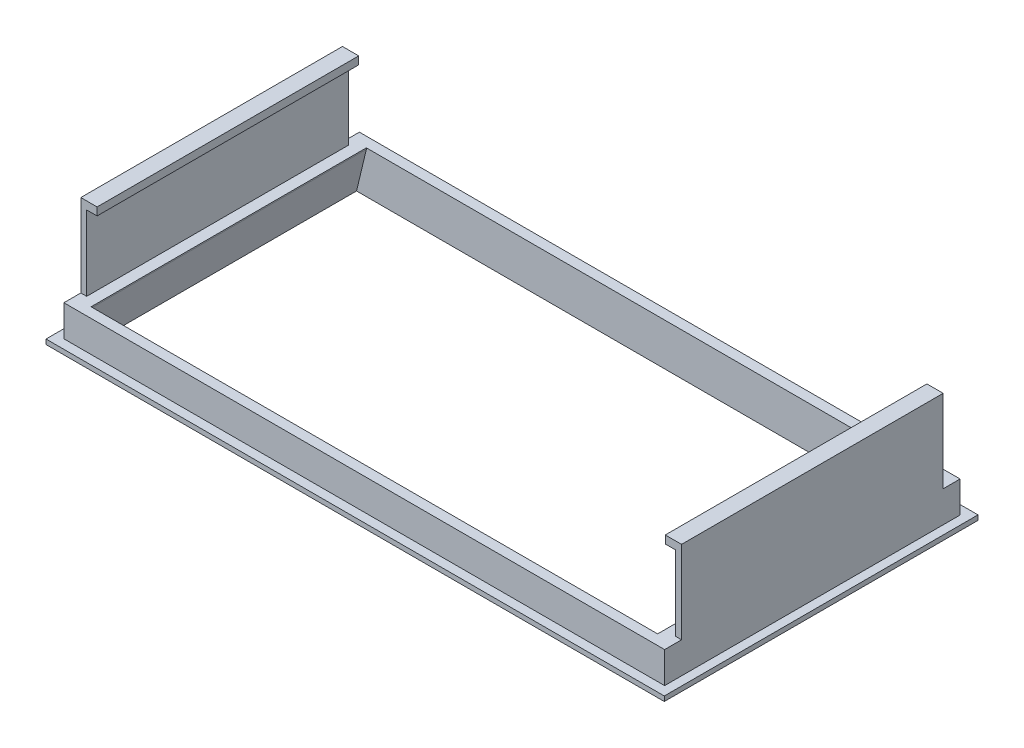
ISO-10303-21;
HEADER;
FILE_DESCRIPTION(('STEP AP214'),'2;1');
FILE_NAME('part.step','',(''),(''),'','','');
FILE_SCHEMA(('AUTOMOTIVE_DESIGN { 1 0 10303 214 1 1 1 1 }'));
ENDSEC;
DATA;
#1=APPLICATION_CONTEXT('core data for automotive mechanical design processes');
#2=APPLICATION_PROTOCOL_DEFINITION('international standard','automotive_design',2000,#1);
#3=PRODUCT_CONTEXT('',#1,'mechanical');
#4=PRODUCT('Part','Part','',(#3));
#5=PRODUCT_RELATED_PRODUCT_CATEGORY('part','',(#4));
#6=PRODUCT_DEFINITION_FORMATION('','',#4);
#7=PRODUCT_DEFINITION_CONTEXT('part definition',#1,'design');
#8=PRODUCT_DEFINITION('design','',#6,#7);
#9=PRODUCT_DEFINITION_SHAPE('','',#8);
#10=(LENGTH_UNIT() NAMED_UNIT(*) SI_UNIT(.MILLI.,.METRE.));
#11=(NAMED_UNIT(*) PLANE_ANGLE_UNIT() SI_UNIT($,.RADIAN.));
#12=(NAMED_UNIT(*) SI_UNIT($,.STERADIAN.) SOLID_ANGLE_UNIT());
#13=UNCERTAINTY_MEASURE_WITH_UNIT(LENGTH_MEASURE(1.E-05),#10,'distance_accuracy_value','');
#14=(GEOMETRIC_REPRESENTATION_CONTEXT(3) GLOBAL_UNCERTAINTY_ASSIGNED_CONTEXT((#13)) GLOBAL_UNIT_ASSIGNED_CONTEXT((#10,
#11,#12)) REPRESENTATION_CONTEXT('',''));
#15=CARTESIAN_POINT('',(0.,0.,0.));
#16=DIRECTION('',(0.,0.,1.));
#17=DIRECTION('',(1.,0.,0.));
#18=AXIS2_PLACEMENT_3D('',#15,#16,#17);
#19=CARTESIAN_POINT('',(-46.15,18.,20.1));
#20=DIRECTION('',(0.,0.,-1.));
#21=DIRECTION('',(-1.,0.,0.));
#22=AXIS2_PLACEMENT_3D('',#19,#20,#21);
#23=PLANE('',#22);
#24=DIRECTION('',(1.,0.,0.));
#25=VECTOR('',#24,1.);
#26=CARTESIAN_POINT('',(-46.15,18.,20.1));
#27=LINE('',#26,#25);
#28=CARTESIAN_POINT('',(-45.25,18.,20.1));
#29=VERTEX_POINT('',#28);
#30=CARTESIAN_POINT('',(-43.65,18.,20.1));
#31=VERTEX_POINT('',#30);
#32=EDGE_CURVE('E238',#29,#31,#27,.T.);
#33=ORIENTED_EDGE('',*,*,#32,.T.);
#34=DIRECTION('',(0.,1.,0.));
#35=VECTOR('',#34,1.);
#36=CARTESIAN_POINT('',(-43.65,18.,20.1));
#37=LINE('',#36,#35);
#38=CARTESIAN_POINT('',(-43.65,19.2,20.1));
#39=VERTEX_POINT('',#38);
#40=EDGE_CURVE('E50',#31,#39,#37,.T.);
#41=ORIENTED_EDGE('',*,*,#40,.T.);
#42=DIRECTION('',(1.,0.,0.));
#43=VECTOR('',#42,1.);
#44=CARTESIAN_POINT('',(-46.15,19.2,20.1));
#45=LINE('',#44,#43);
#46=CARTESIAN_POINT('',(-46.15,19.2,20.1));
#47=VERTEX_POINT('',#46);
#48=EDGE_CURVE('E256',#47,#39,#45,.T.);
#49=ORIENTED_EDGE('',*,*,#48,.F.);
#50=DIRECTION('',(0.,-1.,0.));
#51=VECTOR('',#50,1.);
#52=CARTESIAN_POINT('',(-46.15,18.,20.1));
#53=LINE('',#52,#51);
#54=CARTESIAN_POINT('',(-46.15,6.5,20.1));
#55=VERTEX_POINT('',#54);
#56=EDGE_CURVE('E330',#47,#55,#53,.T.);
#57=ORIENTED_EDGE('',*,*,#56,.T.);
#58=DIRECTION('',(1.,0.,0.));
#59=VECTOR('',#58,1.);
#60=CARTESIAN_POINT('',(-46.15,6.5,20.1));
#61=LINE('',#60,#59);
#62=CARTESIAN_POINT('',(-45.25,6.5,20.1));
#63=VERTEX_POINT('',#62);
#64=EDGE_CURVE('E297',#55,#63,#61,.T.);
#65=ORIENTED_EDGE('',*,*,#64,.T.);
#66=DIRECTION('',(0.,1.,0.));
#67=VECTOR('',#66,1.);
#68=CARTESIAN_POINT('',(-45.25,6.5,20.1));
#69=LINE('',#68,#67);
#70=EDGE_CURVE('E278',#63,#29,#69,.T.);
#71=ORIENTED_EDGE('',*,*,#70,.T.);
#72=EDGE_LOOP('',(#33,#41,#49,#57,#65,#71));
#73=FACE_BOUND('',#72,.T.);
#74=ADVANCED_FACE('F32',(#73),#23,.F.);
#75=CARTESIAN_POINT('',(-46.15,18.,-20.1));
#76=DIRECTION('',(0.,0.,1.));
#77=DIRECTION('',(1.,0.,0.));
#78=AXIS2_PLACEMENT_3D('',#75,#76,#77);
#79=PLANE('',#78);
#80=DIRECTION('',(-1.,0.,0.));
#81=VECTOR('',#80,1.);
#82=CARTESIAN_POINT('',(-46.15,19.2,-20.1));
#83=LINE('',#82,#81);
#84=CARTESIAN_POINT('',(-43.65,19.2,-20.1));
#85=VERTEX_POINT('',#84);
#86=CARTESIAN_POINT('',(-46.15,19.2,-20.1));
#87=VERTEX_POINT('',#86);
#88=EDGE_CURVE('E262',#85,#87,#83,.T.);
#89=ORIENTED_EDGE('',*,*,#88,.F.);
#90=DIRECTION('',(0.,1.,0.));
#91=VECTOR('',#90,1.);
#92=CARTESIAN_POINT('',(-43.65,18.,-20.1));
#93=LINE('',#92,#91);
#94=CARTESIAN_POINT('',(-43.65,18.,-20.1));
#95=VERTEX_POINT('',#94);
#96=EDGE_CURVE('E239',#95,#85,#93,.T.);
#97=ORIENTED_EDGE('',*,*,#96,.F.);
#98=DIRECTION('',(-1.,0.,0.));
#99=VECTOR('',#98,1.);
#100=CARTESIAN_POINT('',(-46.15,18.,-20.1));
#101=LINE('',#100,#99);
#102=CARTESIAN_POINT('',(-45.25,18.,-20.1));
#103=VERTEX_POINT('',#102);
#104=EDGE_CURVE('E241',#95,#103,#101,.T.);
#105=ORIENTED_EDGE('',*,*,#104,.T.);
#106=DIRECTION('',(0.,1.,0.));
#107=VECTOR('',#106,1.);
#108=CARTESIAN_POINT('',(-45.25,6.5,-20.1));
#109=LINE('',#108,#107);
#110=CARTESIAN_POINT('',(-45.25,6.5,-20.1));
#111=VERTEX_POINT('',#110);
#112=EDGE_CURVE('E294',#111,#103,#109,.T.);
#113=ORIENTED_EDGE('',*,*,#112,.F.);
#114=DIRECTION('',(-1.,0.,0.));
#115=VECTOR('',#114,1.);
#116=CARTESIAN_POINT('',(-46.15,6.5,-20.1));
#117=LINE('',#116,#115);
#118=CARTESIAN_POINT('',(-46.15,6.5,-20.1));
#119=VERTEX_POINT('',#118);
#120=EDGE_CURVE('E11',#111,#119,#117,.T.);
#121=ORIENTED_EDGE('',*,*,#120,.T.);
#122=DIRECTION('',(0.,-1.,0.));
#123=VECTOR('',#122,1.);
#124=CARTESIAN_POINT('',(-46.15,18.,-20.1));
#125=LINE('',#124,#123);
#126=EDGE_CURVE('E337',#87,#119,#125,.T.);
#127=ORIENTED_EDGE('',*,*,#126,.F.);
#128=EDGE_LOOP('',(#89,#97,#105,#113,#121,#127));
#129=FACE_BOUND('',#128,.T.);
#130=ADVANCED_FACE('F525',(#129),#79,.F.);
#131=CARTESIAN_POINT('',(-46.15,19.2,20.1));
#132=DIRECTION('',(0.,1.,0.));
#133=DIRECTION('',(0.,0.,1.));
#134=AXIS2_PLACEMENT_3D('',#131,#132,#133);
#135=PLANE('',#134);
#136=DIRECTION('',(0.,0.,1.));
#137=VECTOR('',#136,1.);
#138=CARTESIAN_POINT('',(-43.65,19.2,-20.1));
#139=LINE('',#138,#137);
#140=EDGE_CURVE('E617',#85,#39,#139,.T.);
#141=ORIENTED_EDGE('',*,*,#140,.F.);
#142=ORIENTED_EDGE('',*,*,#88,.T.);
#143=DIRECTION('',(0.,0.,1.));
#144=VECTOR('',#143,1.);
#145=CARTESIAN_POINT('',(-46.15,19.2,-20.1));
#146=LINE('',#145,#144);
#147=EDGE_CURVE('E252',#87,#47,#146,.T.);
#148=ORIENTED_EDGE('',*,*,#147,.T.);
#149=ORIENTED_EDGE('',*,*,#48,.T.);
#150=EDGE_LOOP('',(#141,#142,#148,#149));
#151=FACE_BOUND('',#150,.T.);
#152=ADVANCED_FACE('F531',(#151),#135,.T.);
#153=CARTESIAN_POINT('',(-46.15,18.,20.1));
#154=DIRECTION('',(0.,1.,0.));
#155=DIRECTION('',(0.,0.,1.));
#156=AXIS2_PLACEMENT_3D('',#153,#154,#155);
#157=PLANE('',#156);
#158=ORIENTED_EDGE('',*,*,#104,.F.);
#159=DIRECTION('',(0.,0.,1.));
#160=VECTOR('',#159,1.);
#161=CARTESIAN_POINT('',(-43.65,18.,-20.1));
#162=LINE('',#161,#160);
#163=EDGE_CURVE('E224',#95,#31,#162,.T.);
#164=ORIENTED_EDGE('',*,*,#163,.T.);
#165=ORIENTED_EDGE('',*,*,#32,.F.);
#166=DIRECTION('',(0.,0.,1.));
#167=VECTOR('',#166,1.);
#168=CARTESIAN_POINT('',(-45.25,18.,-20.1));
#169=LINE('',#168,#167);
#170=EDGE_CURVE('E265',#103,#29,#169,.T.);
#171=ORIENTED_EDGE('',*,*,#170,.F.);
#172=EDGE_LOOP('',(#158,#164,#165,#171));
#173=FACE_BOUND('',#172,.T.);
#174=ADVANCED_FACE('F582',(#173),#157,.F.);
#175=CARTESIAN_POINT('',(-47.5,1.7,24.1));
#176=DIRECTION('',(0.,1.,0.));
#177=DIRECTION('',(0.,0.,1.));
#178=AXIS2_PLACEMENT_3D('',#175,#176,#177);
#179=PLANE('',#178);
#180=DIRECTION('',(0.,0.,1.));
#181=VECTOR('',#180,1.);
#182=CARTESIAN_POINT('',(-47.5,1.7,-24.1));
#183=LINE('',#182,#181);
#184=CARTESIAN_POINT('',(-47.5,1.7,-24.1));
#185=VERTEX_POINT('',#184);
#186=CARTESIAN_POINT('',(-47.5,1.7,24.1));
#187=VERTEX_POINT('',#186);
#188=EDGE_CURVE('E387',#185,#187,#183,.T.);
#189=ORIENTED_EDGE('',*,*,#188,.T.);
#190=DIRECTION('',(1.,0.,0.));
#191=VECTOR('',#190,1.);
#192=CARTESIAN_POINT('',(-47.5,1.7,24.1));
#193=LINE('',#192,#191);
#194=CARTESIAN_POINT('',(47.5,1.7,24.1));
#195=VERTEX_POINT('',#194);
#196=EDGE_CURVE('E390',#187,#195,#193,.T.);
#197=ORIENTED_EDGE('',*,*,#196,.T.);
#198=DIRECTION('',(0.,0.,-1.));
#199=VECTOR('',#198,1.);
#200=CARTESIAN_POINT('',(47.5,1.7,-24.1));
#201=LINE('',#200,#199);
#202=CARTESIAN_POINT('',(47.5,1.7,-24.1));
#203=VERTEX_POINT('',#202);
#204=EDGE_CURVE('E392',#195,#203,#201,.T.);
#205=ORIENTED_EDGE('',*,*,#204,.T.);
#206=DIRECTION('',(-1.,0.,0.));
#207=VECTOR('',#206,1.);
#208=CARTESIAN_POINT('',(-47.5,1.7,-24.1));
#209=LINE('',#208,#207);
#210=EDGE_CURVE('E394',#203,#185,#209,.T.);
#211=ORIENTED_EDGE('',*,*,#210,.T.);
#212=EDGE_LOOP('',(#189,#197,#205,#211));
#213=FACE_BOUND('',#212,.T.);
#214=DIRECTION('',(1.,0.,0.));
#215=VECTOR('',#214,1.);
#216=CARTESIAN_POINT('',(-46.15,1.7,22.7));
#217=LINE('',#216,#215);
#218=CARTESIAN_POINT('',(-46.15,1.7,22.7));
#219=VERTEX_POINT('',#218);
#220=CARTESIAN_POINT('',(46.15,1.7,22.7));
#221=VERTEX_POINT('',#220);
#222=EDGE_CURVE('E369',#219,#221,#217,.T.);
#223=ORIENTED_EDGE('',*,*,#222,.F.);
#224=DIRECTION('',(0.,0.,1.));
#225=VECTOR('',#224,1.);
#226=CARTESIAN_POINT('',(-46.15,1.7,-22.7));
#227=LINE('',#226,#225);
#228=CARTESIAN_POINT('',(-46.15,1.7,-22.7));
#229=VERTEX_POINT('',#228);
#230=EDGE_CURVE('E366',#229,#219,#227,.T.);
#231=ORIENTED_EDGE('',*,*,#230,.F.);
#232=DIRECTION('',(-1.,0.,0.));
#233=VECTOR('',#232,1.);
#234=CARTESIAN_POINT('',(-46.15,1.7,-22.7));
#235=LINE('',#234,#233);
#236=CARTESIAN_POINT('',(46.15,1.7,-22.7));
#237=VERTEX_POINT('',#236);
#238=EDGE_CURVE('E375',#237,#229,#235,.T.);
#239=ORIENTED_EDGE('',*,*,#238,.F.);
#240=DIRECTION('',(0.,0.,-1.));
#241=VECTOR('',#240,1.);
#242=CARTESIAN_POINT('',(46.15,1.7,-22.7));
#243=LINE('',#242,#241);
#244=EDGE_CURVE('E372',#221,#237,#243,.T.);
#245=ORIENTED_EDGE('',*,*,#244,.F.);
#246=EDGE_LOOP('',(#223,#231,#239,#245));
#247=FACE_BOUND('',#246,.T.);
#248=ADVANCED_FACE('F564',(#213,#247),#179,.T.);
#249=CARTESIAN_POINT('',(-47.5,1.7,-24.1));
#250=DIRECTION('',(1.,0.,0.));
#251=DIRECTION('',(0.,0.,-1.));
#252=AXIS2_PLACEMENT_3D('',#249,#250,#251);
#253=PLANE('',#252);
#254=DIRECTION('',(0.,-1.,0.));
#255=VECTOR('',#254,1.);
#256=CARTESIAN_POINT('',(-47.5,1.7,-24.1));
#257=LINE('',#256,#255);
#258=CARTESIAN_POINT('',(-47.5,0.960000000000002,-24.1));
#259=VERTEX_POINT('',#258);
#260=EDGE_CURVE('E396',#185,#259,#257,.T.);
#261=ORIENTED_EDGE('',*,*,#260,.T.);
#262=DIRECTION('',(0.,0.,1.));
#263=VECTOR('',#262,1.);
#264=CARTESIAN_POINT('',(-47.5,0.960000000000016,-24.1));
#265=LINE('',#264,#263);
#266=CARTESIAN_POINT('',(-47.5,0.960000000000013,24.1));
#267=VERTEX_POINT('',#266);
#268=EDGE_CURVE('E421',#259,#267,#265,.T.);
#269=ORIENTED_EDGE('',*,*,#268,.T.);
#270=DIRECTION('',(0.,-1.,0.));
#271=VECTOR('',#270,1.);
#272=CARTESIAN_POINT('',(-47.5,1.7,24.1));
#273=LINE('',#272,#271);
#274=EDGE_CURVE('E405',#187,#267,#273,.T.);
#275=ORIENTED_EDGE('',*,*,#274,.F.);
#276=ORIENTED_EDGE('',*,*,#188,.F.);
#277=EDGE_LOOP('',(#261,#269,#275,#276));
#278=FACE_BOUND('',#277,.T.);
#279=ADVANCED_FACE('F560',(#278),#253,.F.);
#280=CARTESIAN_POINT('',(-47.5,1.7,24.1));
#281=DIRECTION('',(0.,0.,-1.));
#282=DIRECTION('',(-1.,0.,0.));
#283=AXIS2_PLACEMENT_3D('',#280,#281,#282);
#284=PLANE('',#283);
#285=ORIENTED_EDGE('',*,*,#274,.T.);
#286=DIRECTION('',(1.,0.,0.));
#287=VECTOR('',#286,1.);
#288=CARTESIAN_POINT('',(-47.5,0.959999999999989,24.1));
#289=LINE('',#288,#287);
#290=CARTESIAN_POINT('',(47.5,0.960000000000003,24.1));
#291=VERTEX_POINT('',#290);
#292=EDGE_CURVE('E428',#267,#291,#289,.T.);
#293=ORIENTED_EDGE('',*,*,#292,.T.);
#294=DIRECTION('',(0.,-1.,0.));
#295=VECTOR('',#294,1.);
#296=CARTESIAN_POINT('',(47.5,1.7,24.1));
#297=LINE('',#296,#295);
#298=EDGE_CURVE('E402',#195,#291,#297,.T.);
#299=ORIENTED_EDGE('',*,*,#298,.F.);
#300=ORIENTED_EDGE('',*,*,#196,.F.);
#301=EDGE_LOOP('',(#285,#293,#299,#300));
#302=FACE_BOUND('',#301,.T.);
#303=ADVANCED_FACE('F563',(#302),#284,.F.);
#304=CARTESIAN_POINT('',(47.5,1.7,-24.1));
#305=DIRECTION('',(-1.,0.,0.));
#306=DIRECTION('',(0.,0.,1.));
#307=AXIS2_PLACEMENT_3D('',#304,#305,#306);
#308=PLANE('',#307);
#309=ORIENTED_EDGE('',*,*,#298,.T.);
#310=DIRECTION('',(0.,0.,-1.));
#311=VECTOR('',#310,1.);
#312=CARTESIAN_POINT('',(47.5,0.960000000000003,-24.1));
#313=LINE('',#312,#311);
#314=CARTESIAN_POINT('',(47.5,0.960000000000003,-24.1));
#315=VERTEX_POINT('',#314);
#316=EDGE_CURVE('E408',#291,#315,#313,.T.);
#317=ORIENTED_EDGE('',*,*,#316,.T.);
#318=DIRECTION('',(0.,-1.,0.));
#319=VECTOR('',#318,1.);
#320=CARTESIAN_POINT('',(47.5,1.7,-24.1));
#321=LINE('',#320,#319);
#322=EDGE_CURVE('E399',#203,#315,#321,.T.);
#323=ORIENTED_EDGE('',*,*,#322,.F.);
#324=ORIENTED_EDGE('',*,*,#204,.F.);
#325=EDGE_LOOP('',(#309,#317,#323,#324));
#326=FACE_BOUND('',#325,.T.);
#327=ADVANCED_FACE('F568',(#326),#308,.F.);
#328=CARTESIAN_POINT('',(-47.5,1.7,-24.1));
#329=DIRECTION('',(0.,0.,1.));
#330=DIRECTION('',(1.,0.,0.));
#331=AXIS2_PLACEMENT_3D('',#328,#329,#330);
#332=PLANE('',#331);
#333=ORIENTED_EDGE('',*,*,#322,.T.);
#334=DIRECTION('',(-1.,0.,0.));
#335=VECTOR('',#334,1.);
#336=CARTESIAN_POINT('',(-47.5,0.960000000000003,-24.1));
#337=LINE('',#336,#335);
#338=EDGE_CURVE('E414',#315,#259,#337,.T.);
#339=ORIENTED_EDGE('',*,*,#338,.T.);
#340=ORIENTED_EDGE('',*,*,#260,.F.);
#341=ORIENTED_EDGE('',*,*,#210,.F.);
#342=EDGE_LOOP('',(#333,#339,#340,#341));
#343=FACE_BOUND('',#342,.T.);
#344=ADVANCED_FACE('F572',(#343),#332,.F.);
#345=CARTESIAN_POINT('',(-47.5,0.,24.1));
#346=DIRECTION('',(0.,1.,0.));
#347=DIRECTION('',(0.,0.,1.));
#348=AXIS2_PLACEMENT_3D('',#345,#346,#347);
#349=PLANE('',#348);
#350=DIRECTION('',(0.,0.,-1.));
#351=VECTOR('',#350,1.);
#352=CARTESIAN_POINT('',(45.035,0.,24.1));
#353=LINE('',#352,#351);
#354=CARTESIAN_POINT('',(45.035,0.,21.15));
#355=VERTEX_POINT('',#354);
#356=CARTESIAN_POINT('',(45.035,0.,-21.15));
#357=VERTEX_POINT('',#356);
#358=EDGE_CURVE('E447',#355,#357,#353,.T.);
#359=ORIENTED_EDGE('',*,*,#358,.T.);
#360=DIRECTION('',(-1.,0.,0.));
#361=VECTOR('',#360,1.);
#362=CARTESIAN_POINT('',(-43.525,0.,-21.15));
#363=LINE('',#362,#361);
#364=CARTESIAN_POINT('',(-45.035,0.,-21.15));
#365=VERTEX_POINT('',#364);
#366=EDGE_CURVE('E465',#357,#365,#363,.T.);
#367=ORIENTED_EDGE('',*,*,#366,.T.);
#368=DIRECTION('',(0.,0.,1.));
#369=VECTOR('',#368,1.);
#370=CARTESIAN_POINT('',(-45.035,0.,24.1));
#371=LINE('',#370,#369);
#372=CARTESIAN_POINT('',(-45.035,0.,21.15));
#373=VERTEX_POINT('',#372);
#374=EDGE_CURVE('E437',#365,#373,#371,.T.);
#375=ORIENTED_EDGE('',*,*,#374,.T.);
#376=DIRECTION('',(1.,0.,0.));
#377=VECTOR('',#376,1.);
#378=CARTESIAN_POINT('',(-43.525,0.,21.15));
#379=LINE('',#378,#377);
#380=EDGE_CURVE('E474',#373,#355,#379,.T.);
#381=ORIENTED_EDGE('',*,*,#380,.T.);
#382=EDGE_LOOP('',(#359,#367,#375,#381));
#383=FACE_BOUND('',#382,.T.);
#384=DIRECTION('',(0.,0.,1.));
#385=VECTOR('',#384,1.);
#386=CARTESIAN_POINT('',(46.54,0.,24.1));
#387=LINE('',#386,#385);
#388=CARTESIAN_POINT('',(46.54,0.,-23.14));
#389=VERTEX_POINT('',#388);
#390=CARTESIAN_POINT('',(46.54,0.,23.14));
#391=VERTEX_POINT('',#390);
#392=EDGE_CURVE('E411',#389,#391,#387,.T.);
#393=ORIENTED_EDGE('',*,*,#392,.T.);
#394=DIRECTION('',(-1.,0.,0.));
#395=VECTOR('',#394,1.);
#396=CARTESIAN_POINT('',(-47.5,0.,23.14));
#397=LINE('',#396,#395);
#398=CARTESIAN_POINT('',(-46.54,0.,23.14));
#399=VERTEX_POINT('',#398);
#400=EDGE_CURVE('E433',#391,#399,#397,.T.);
#401=ORIENTED_EDGE('',*,*,#400,.T.);
#402=DIRECTION('',(0.,0.,-1.));
#403=VECTOR('',#402,1.);
#404=CARTESIAN_POINT('',(-46.54,0.,24.1));
#405=LINE('',#404,#403);
#406=CARTESIAN_POINT('',(-46.54,0.,-23.14));
#407=VERTEX_POINT('',#406);
#408=EDGE_CURVE('E424',#399,#407,#405,.T.);
#409=ORIENTED_EDGE('',*,*,#408,.T.);
#410=DIRECTION('',(1.,0.,0.));
#411=VECTOR('',#410,1.);
#412=CARTESIAN_POINT('',(-47.5,0.,-23.14));
#413=LINE('',#412,#411);
#414=EDGE_CURVE('E417',#407,#389,#413,.T.);
#415=ORIENTED_EDGE('',*,*,#414,.T.);
#416=EDGE_LOOP('',(#393,#401,#409,#415));
#417=FACE_BOUND('',#416,.T.);
#418=ADVANCED_FACE('F482',(#383,#417),#349,.F.);
#419=CARTESIAN_POINT('',(-46.15,6.5,-22.7));
#420=DIRECTION('',(1.,0.,0.));
#421=DIRECTION('',(0.,0.,-1.));
#422=AXIS2_PLACEMENT_3D('',#419,#420,#421);
#423=PLANE('',#422);
#424=ORIENTED_EDGE('',*,*,#230,.T.);
#425=DIRECTION('',(0.,-1.,0.));
#426=VECTOR('',#425,1.);
#427=CARTESIAN_POINT('',(-46.15,6.5,22.7));
#428=LINE('',#427,#426);
#429=CARTESIAN_POINT('',(-46.15,6.5,22.7));
#430=VERTEX_POINT('',#429);
#431=EDGE_CURVE('E385',#430,#219,#428,.T.);
#432=ORIENTED_EDGE('',*,*,#431,.F.);
#433=DIRECTION('',(0.,0.,1.));
#434=VECTOR('',#433,1.);
#435=CARTESIAN_POINT('',(-46.15,6.5,-22.7));
#436=LINE('',#435,#434);
#437=EDGE_CURVE('E377',#55,#430,#436,.T.);
#438=ORIENTED_EDGE('',*,*,#437,.F.);
#439=ORIENTED_EDGE('',*,*,#56,.F.);
#440=ORIENTED_EDGE('',*,*,#147,.F.);
#441=ORIENTED_EDGE('',*,*,#126,.T.);
#442=CARTESIAN_POINT('',(-46.15,6.5,-22.7));
#443=VERTEX_POINT('',#442);
#444=EDGE_CURVE('E456',#443,#119,#436,.T.);
#445=ORIENTED_EDGE('',*,*,#444,.F.);
#446=DIRECTION('',(0.,-1.,0.));
#447=VECTOR('',#446,1.);
#448=CARTESIAN_POINT('',(-46.15,6.5,-22.7));
#449=LINE('',#448,#447);
#450=EDGE_CURVE('E365',#443,#229,#449,.T.);
#451=ORIENTED_EDGE('',*,*,#450,.T.);
#452=EDGE_LOOP('',(#424,#432,#438,#439,#440,#441,#445,#451));
#453=FACE_BOUND('',#452,.T.);
#454=ADVANCED_FACE('F579',(#453),#423,.F.);
#455=CARTESIAN_POINT('',(-46.15,6.5,22.7));
#456=DIRECTION('',(0.,0.,-1.));
#457=DIRECTION('',(-1.,0.,0.));
#458=AXIS2_PLACEMENT_3D('',#455,#456,#457);
#459=PLANE('',#458);
#460=ORIENTED_EDGE('',*,*,#222,.T.);
#461=DIRECTION('',(0.,-1.,0.));
#462=VECTOR('',#461,1.);
#463=CARTESIAN_POINT('',(46.15,6.5,22.7));
#464=LINE('',#463,#462);
#465=CARTESIAN_POINT('',(46.15,6.5,22.7));
#466=VERTEX_POINT('',#465);
#467=EDGE_CURVE('E382',#466,#221,#464,.T.);
#468=ORIENTED_EDGE('',*,*,#467,.F.);
#469=DIRECTION('',(1.,0.,0.));
#470=VECTOR('',#469,1.);
#471=CARTESIAN_POINT('',(-46.15,6.5,22.7));
#472=LINE('',#471,#470);
#473=EDGE_CURVE('E356',#430,#466,#472,.T.);
#474=ORIENTED_EDGE('',*,*,#473,.F.);
#475=ORIENTED_EDGE('',*,*,#431,.T.);
#476=EDGE_LOOP('',(#460,#468,#474,#475));
#477=FACE_BOUND('',#476,.T.);
#478=ADVANCED_FACE('F586',(#477),#459,.F.);
#479=CARTESIAN_POINT('',(46.15,6.5,-22.7));
#480=DIRECTION('',(-1.,0.,0.));
#481=DIRECTION('',(0.,0.,1.));
#482=AXIS2_PLACEMENT_3D('',#479,#480,#481);
#483=PLANE('',#482);
#484=ORIENTED_EDGE('',*,*,#244,.T.);
#485=DIRECTION('',(0.,-1.,0.));
#486=VECTOR('',#485,1.);
#487=CARTESIAN_POINT('',(46.15,6.5,-22.7));
#488=LINE('',#487,#486);
#489=CARTESIAN_POINT('',(46.15,6.5,-22.7));
#490=VERTEX_POINT('',#489);
#491=EDGE_CURVE('E380',#490,#237,#488,.T.);
#492=ORIENTED_EDGE('',*,*,#491,.F.);
#493=DIRECTION('',(0.,0.,-1.));
#494=VECTOR('',#493,1.);
#495=CARTESIAN_POINT('',(46.15,6.5,-22.7));
#496=LINE('',#495,#494);
#497=CARTESIAN_POINT('',(46.15,6.5,-20.1));
#498=VERTEX_POINT('',#497);
#499=EDGE_CURVE('E352',#498,#490,#496,.T.);
#500=ORIENTED_EDGE('',*,*,#499,.F.);
#501=DIRECTION('',(0.,-1.,0.));
#502=VECTOR('',#501,1.);
#503=CARTESIAN_POINT('',(46.15,18.,-20.1));
#504=LINE('',#503,#502);
#505=CARTESIAN_POINT('',(46.15,19.2,-20.1));
#506=VERTEX_POINT('',#505);
#507=EDGE_CURVE('E339',#506,#498,#504,.T.);
#508=ORIENTED_EDGE('',*,*,#507,.F.);
#509=DIRECTION('',(0.,0.,-1.));
#510=VECTOR('',#509,1.);
#511=CARTESIAN_POINT('',(46.15,19.2,-20.1));
#512=LINE('',#511,#510);
#513=CARTESIAN_POINT('',(46.15,19.2,20.1));
#514=VERTEX_POINT('',#513);
#515=EDGE_CURVE('E259',#514,#506,#512,.T.);
#516=ORIENTED_EDGE('',*,*,#515,.F.);
#517=DIRECTION('',(0.,-1.,0.));
#518=VECTOR('',#517,1.);
#519=CARTESIAN_POINT('',(46.15,18.,20.1));
#520=LINE('',#519,#518);
#521=CARTESIAN_POINT('',(46.15,6.5,20.1));
#522=VERTEX_POINT('',#521);
#523=EDGE_CURVE('E334',#514,#522,#520,.T.);
#524=ORIENTED_EDGE('',*,*,#523,.T.);
#525=EDGE_CURVE('E355',#466,#522,#496,.T.);
#526=ORIENTED_EDGE('',*,*,#525,.F.);
#527=ORIENTED_EDGE('',*,*,#467,.T.);
#528=EDGE_LOOP('',(#484,#492,#500,#508,#516,#524,#526,#527));
#529=FACE_BOUND('',#528,.T.);
#530=ADVANCED_FACE('F589',(#529),#483,.F.);
#531=CARTESIAN_POINT('',(-46.15,6.5,-22.7));
#532=DIRECTION('',(0.,0.,1.));
#533=DIRECTION('',(1.,0.,0.));
#534=AXIS2_PLACEMENT_3D('',#531,#532,#533);
#535=PLANE('',#534);
#536=ORIENTED_EDGE('',*,*,#238,.T.);
#537=ORIENTED_EDGE('',*,*,#450,.F.);
#538=DIRECTION('',(-1.,0.,0.));
#539=VECTOR('',#538,1.);
#540=CARTESIAN_POINT('',(-46.15,6.5,-22.7));
#541=LINE('',#540,#539);
#542=EDGE_CURVE('E362',#490,#443,#541,.T.);
#543=ORIENTED_EDGE('',*,*,#542,.F.);
#544=ORIENTED_EDGE('',*,*,#491,.T.);
#545=EDGE_LOOP('',(#536,#537,#543,#544));
#546=FACE_BOUND('',#545,.T.);
#547=ADVANCED_FACE('F521',(#546),#535,.F.);
#548=CARTESIAN_POINT('',(-46.15,6.5,22.7));
#549=DIRECTION('',(0.,1.,0.));
#550=DIRECTION('',(0.,0.,1.));
#551=AXIS2_PLACEMENT_3D('',#548,#549,#550);
#552=PLANE('',#551);
#553=DIRECTION('',(1.,0.,0.));
#554=VECTOR('',#553,1.);
#555=CARTESIAN_POINT('',(-43.525,6.5,21.15));
#556=LINE('',#555,#554);
#557=CARTESIAN_POINT('',(-43.525,6.5,21.15));
#558=VERTEX_POINT('',#557);
#559=CARTESIAN_POINT('',(43.525,6.5,21.15));
#560=VERTEX_POINT('',#559);
#561=EDGE_CURVE('E477',#558,#560,#556,.T.);
#562=ORIENTED_EDGE('',*,*,#561,.F.);
#563=DIRECTION('',(0.,0.,1.));
#564=VECTOR('',#563,1.);
#565=CARTESIAN_POINT('',(-43.525,6.5,-21.15));
#566=LINE('',#565,#564);
#567=CARTESIAN_POINT('',(-43.525,6.5,-21.15));
#568=VERTEX_POINT('',#567);
#569=EDGE_CURVE('E333',#568,#558,#566,.T.);
#570=ORIENTED_EDGE('',*,*,#569,.F.);
#571=DIRECTION('',(-1.,0.,0.));
#572=VECTOR('',#571,1.);
#573=CARTESIAN_POINT('',(-43.525,6.5,-21.15));
#574=LINE('',#573,#572);
#575=CARTESIAN_POINT('',(43.525,6.5,-21.15));
#576=VERTEX_POINT('',#575);
#577=EDGE_CURVE('E471',#576,#568,#574,.T.);
#578=ORIENTED_EDGE('',*,*,#577,.F.);
#579=DIRECTION('',(0.,0.,-1.));
#580=VECTOR('',#579,1.);
#581=CARTESIAN_POINT('',(43.525,6.5,-21.15));
#582=LINE('',#581,#580);
#583=EDGE_CURVE('E475',#560,#576,#582,.T.);
#584=ORIENTED_EDGE('',*,*,#583,.F.);
#585=EDGE_LOOP('',(#562,#570,#578,#584));
#586=FACE_BOUND('',#585,.T.);
#587=ORIENTED_EDGE('',*,*,#64,.F.);
#588=ORIENTED_EDGE('',*,*,#437,.T.);
#589=ORIENTED_EDGE('',*,*,#473,.T.);
#590=ORIENTED_EDGE('',*,*,#525,.T.);
#591=CARTESIAN_POINT('',(45.25,6.5,20.1));
#592=VERTEX_POINT('',#591);
#593=EDGE_CURVE('E42',#592,#522,#61,.T.);
#594=ORIENTED_EDGE('',*,*,#593,.F.);
#595=DIRECTION('',(0.,0.,-1.));
#596=VECTOR('',#595,1.);
#597=CARTESIAN_POINT('',(45.25,6.5,-20.1));
#598=LINE('',#597,#596);
#599=CARTESIAN_POINT('',(45.25,6.5,-20.1));
#600=VERTEX_POINT('',#599);
#601=EDGE_CURVE('E275',#592,#600,#598,.T.);
#602=ORIENTED_EDGE('',*,*,#601,.T.);
#603=EDGE_CURVE('E327',#498,#600,#117,.T.);
#604=ORIENTED_EDGE('',*,*,#603,.F.);
#605=ORIENTED_EDGE('',*,*,#499,.T.);
#606=ORIENTED_EDGE('',*,*,#542,.T.);
#607=ORIENTED_EDGE('',*,*,#444,.T.);
#608=ORIENTED_EDGE('',*,*,#120,.F.);
#609=DIRECTION('',(0.,0.,1.));
#610=VECTOR('',#609,1.);
#611=CARTESIAN_POINT('',(-45.25,6.5,-20.1));
#612=LINE('',#611,#610);
#613=EDGE_CURVE('E272',#111,#63,#612,.T.);
#614=ORIENTED_EDGE('',*,*,#613,.T.);
#615=EDGE_LOOP('',(#587,#588,#589,#590,#594,#602,#604,#605,#606,#607,#608,#614));
#616=FACE_BOUND('',#615,.T.);
#617=ADVANCED_FACE('F503',(#586,#616),#552,.T.);
#618=CARTESIAN_POINT('',(-43.525,0.,-21.15));
#619=DIRECTION('',(-1.,0.,0.));
#620=DIRECTION('',(0.,0.,1.));
#621=AXIS2_PLACEMENT_3D('',#618,#619,#620);
#622=PLANE('',#621);
#623=DIRECTION('',(0.,1.,0.));
#624=VECTOR('',#623,1.);
#625=CARTESIAN_POINT('',(-43.525,0.,21.15));
#626=LINE('',#625,#624);
#627=CARTESIAN_POINT('',(-43.525,6.31000000000006,21.15));
#628=VERTEX_POINT('',#627);
#629=EDGE_CURVE('E460',#628,#558,#626,.T.);
#630=ORIENTED_EDGE('',*,*,#629,.F.);
#631=DIRECTION('',(0.,0.,-1.));
#632=VECTOR('',#631,1.);
#633=CARTESIAN_POINT('',(-43.525,6.31000000000007,-21.15));
#634=LINE('',#633,#632);
#635=CARTESIAN_POINT('',(-43.525,6.31000000000006,-21.15));
#636=VERTEX_POINT('',#635);
#637=EDGE_CURVE('E440',#628,#636,#634,.T.);
#638=ORIENTED_EDGE('',*,*,#637,.T.);
#639=DIRECTION('',(0.,1.,0.));
#640=VECTOR('',#639,1.);
#641=CARTESIAN_POINT('',(-43.525,0.,-21.15));
#642=LINE('',#641,#640);
#643=EDGE_CURVE('E370',#636,#568,#642,.T.);
#644=ORIENTED_EDGE('',*,*,#643,.T.);
#645=ORIENTED_EDGE('',*,*,#569,.T.);
#646=EDGE_LOOP('',(#630,#638,#644,#645));
#647=FACE_BOUND('',#646,.T.);
#648=ADVANCED_FACE('F513',(#647),#622,.F.);
#649=CARTESIAN_POINT('',(-43.525,0.,-21.15));
#650=DIRECTION('',(0.,0.,-1.));
#651=DIRECTION('',(-1.,0.,0.));
#652=AXIS2_PLACEMENT_3D('',#649,#650,#651);
#653=PLANE('',#652);
#654=ORIENTED_EDGE('',*,*,#577,.T.);
#655=ORIENTED_EDGE('',*,*,#643,.F.);
#656=DIRECTION('',(0.232731677706915,0.972540984324941,0.));
#657=VECTOR('',#656,1.);
#658=CARTESIAN_POINT('',(-44.9532123089495,0.341775053330222,-21.15));
#659=LINE('',#658,#657);
#660=EDGE_CURVE('E444',#636,#365,#659,.F.);
#661=ORIENTED_EDGE('',*,*,#660,.T.);
#662=ORIENTED_EDGE('',*,*,#366,.F.);
#663=DIRECTION('',(0.232731677706917,-0.97254098432494,0.));
#664=VECTOR('',#663,1.);
#665=CARTESIAN_POINT('',(40.2382331659391,20.0447673661754,-21.15));
#666=LINE('',#665,#664);
#667=CARTESIAN_POINT('',(43.525,6.31000000000008,-21.15));
#668=VERTEX_POINT('',#667);
#669=EDGE_CURVE('E452',#357,#668,#666,.F.);
#670=ORIENTED_EDGE('',*,*,#669,.T.);
#671=DIRECTION('',(0.,1.,0.));
#672=VECTOR('',#671,1.);
#673=CARTESIAN_POINT('',(43.525,0.,-21.15));
#674=LINE('',#673,#672);
#675=EDGE_CURVE('E467',#668,#576,#674,.T.);
#676=ORIENTED_EDGE('',*,*,#675,.T.);
#677=EDGE_LOOP('',(#654,#655,#661,#662,#670,#676));
#678=FACE_BOUND('',#677,.T.);
#679=ADVANCED_FACE('F496',(#678),#653,.F.);
#680=CARTESIAN_POINT('',(43.525,0.,-21.15));
#681=DIRECTION('',(1.,0.,0.));
#682=DIRECTION('',(0.,0.,-1.));
#683=AXIS2_PLACEMENT_3D('',#680,#681,#682);
#684=PLANE('',#683);
#685=ORIENTED_EDGE('',*,*,#675,.F.);
#686=DIRECTION('',(0.,0.,1.));
#687=VECTOR('',#686,1.);
#688=CARTESIAN_POINT('',(43.525,6.31000000000008,-21.15));
#689=LINE('',#688,#687);
#690=CARTESIAN_POINT('',(43.525,6.31000000000008,21.15));
#691=VERTEX_POINT('',#690);
#692=EDGE_CURVE('E450',#668,#691,#689,.T.);
#693=ORIENTED_EDGE('',*,*,#692,.T.);
#694=DIRECTION('',(0.,1.,0.));
#695=VECTOR('',#694,1.);
#696=CARTESIAN_POINT('',(43.525,0.,21.15));
#697=LINE('',#696,#695);
#698=EDGE_CURVE('E464',#691,#560,#697,.T.);
#699=ORIENTED_EDGE('',*,*,#698,.T.);
#700=ORIENTED_EDGE('',*,*,#583,.T.);
#701=EDGE_LOOP('',(#685,#693,#699,#700));
#702=FACE_BOUND('',#701,.T.);
#703=ADVANCED_FACE('F499',(#702),#684,.F.);
#704=CARTESIAN_POINT('',(-43.525,0.,21.15));
#705=DIRECTION('',(0.,0.,1.));
#706=DIRECTION('',(1.,0.,0.));
#707=AXIS2_PLACEMENT_3D('',#704,#705,#706);
#708=PLANE('',#707);
#709=ORIENTED_EDGE('',*,*,#561,.T.);
#710=ORIENTED_EDGE('',*,*,#698,.F.);
#711=DIRECTION('',(-0.232731677706917,0.97254098432494,0.));
#712=VECTOR('',#711,1.);
#713=CARTESIAN_POINT('',(40.2382331659391,20.0447673661754,21.15));
#714=LINE('',#713,#712);
#715=EDGE_CURVE('E316',#691,#355,#714,.F.);
#716=ORIENTED_EDGE('',*,*,#715,.T.);
#717=ORIENTED_EDGE('',*,*,#380,.F.);
#718=DIRECTION('',(-0.232731677706915,-0.972540984324941,0.));
#719=VECTOR('',#718,1.);
#720=CARTESIAN_POINT('',(-44.9532123089495,0.341775053330222,21.15));
#721=LINE('',#720,#719);
#722=EDGE_CURVE('E442',#373,#628,#721,.F.);
#723=ORIENTED_EDGE('',*,*,#722,.T.);
#724=ORIENTED_EDGE('',*,*,#629,.T.);
#725=EDGE_LOOP('',(#709,#710,#716,#717,#723,#724));
#726=FACE_BOUND('',#725,.T.);
#727=ADVANCED_FACE('F490',(#726),#708,.F.);
#728=CARTESIAN_POINT('',(47.5,0.960000000000003,-24.1));
#729=DIRECTION('',(-0.707106781186545,0.70710678118655,0.));
#730=DIRECTION('',(-0.70710678118655,-0.707106781186545,0.));
#731=AXIS2_PLACEMENT_3D('',#728,#729,#730);
#732=PLANE('',#731);
#733=ORIENTED_EDGE('',*,*,#316,.F.);
#734=DIRECTION('',(-0.577350269189629,-0.577350269189624,-0.577350269189624));
#735=VECTOR('',#734,1.);
#736=CARTESIAN_POINT('',(31.4333333333333,-15.1066666666666,8.03333333333342));
#737=LINE('',#736,#735);
#738=EDGE_CURVE('E431',#291,#391,#737,.T.);
#739=ORIENTED_EDGE('',*,*,#738,.T.);
#740=ORIENTED_EDGE('',*,*,#392,.F.);
#741=DIRECTION('',(0.577350269189629,0.577350269189625,-0.577350269189623));
#742=VECTOR('',#741,1.);
#743=CARTESIAN_POINT('',(47.5,0.960000000000003,-24.1));
#744=LINE('',#743,#742);
#745=EDGE_CURVE('E419',#389,#315,#744,.T.);
#746=ORIENTED_EDGE('',*,*,#745,.T.);
#747=EDGE_LOOP('',(#733,#739,#740,#746));
#748=FACE_BOUND('',#747,.T.);
#749=ADVANCED_FACE('F555',(#748),#732,.F.);
#750=CARTESIAN_POINT('',(-47.5,0.960000000000003,-24.1));
#751=DIRECTION('',(0.,0.707106781186546,0.707106781186549));
#752=DIRECTION('',(0.,-0.707106781186549,0.707106781186546));
#753=AXIS2_PLACEMENT_3D('',#750,#751,#752);
#754=PLANE('',#753);
#755=ORIENTED_EDGE('',*,*,#414,.F.);
#756=DIRECTION('',(-0.577350269189627,0.577350269189626,-0.577350269189624));
#757=VECTOR('',#756,1.);
#758=CARTESIAN_POINT('',(-47.5,0.960000000000007,-24.1));
#759=LINE('',#758,#757);
#760=EDGE_CURVE('E426',#407,#259,#759,.T.);
#761=ORIENTED_EDGE('',*,*,#760,.T.);
#762=ORIENTED_EDGE('',*,*,#338,.F.);
#763=ORIENTED_EDGE('',*,*,#745,.F.);
#764=EDGE_LOOP('',(#755,#761,#762,#763));
#765=FACE_BOUND('',#764,.T.);
#766=ADVANCED_FACE('F551',(#765),#754,.F.);
#767=CARTESIAN_POINT('',(-47.5,0.960000000000016,-24.1));
#768=DIRECTION('',(0.707106781186548,0.707106781186548,0.));
#769=DIRECTION('',(-0.707106781186548,0.707106781186548,0.));
#770=AXIS2_PLACEMENT_3D('',#767,#768,#769);
#771=PLANE('',#770);
#772=ORIENTED_EDGE('',*,*,#408,.F.);
#773=DIRECTION('',(-0.577350269189626,0.577350269189626,0.577350269189626));
#774=VECTOR('',#773,1.);
#775=CARTESIAN_POINT('',(-31.4333333333333,-15.1066666666667,8.03333333333336));
#776=LINE('',#775,#774);
#777=EDGE_CURVE('E435',#399,#267,#776,.T.);
#778=ORIENTED_EDGE('',*,*,#777,.T.);
#779=ORIENTED_EDGE('',*,*,#268,.F.);
#780=ORIENTED_EDGE('',*,*,#760,.F.);
#781=EDGE_LOOP('',(#772,#778,#779,#780));
#782=FACE_BOUND('',#781,.T.);
#783=ADVANCED_FACE('F545',(#782),#771,.F.);
#784=CARTESIAN_POINT('',(-47.5,0.959999999999989,24.1));
#785=DIRECTION('',(0.,0.707106781186548,-0.707106781186548));
#786=DIRECTION('',(0.,0.707106781186548,0.707106781186548));
#787=AXIS2_PLACEMENT_3D('',#784,#785,#786);
#788=PLANE('',#787);
#789=ORIENTED_EDGE('',*,*,#777,.F.);
#790=ORIENTED_EDGE('',*,*,#400,.F.);
#791=ORIENTED_EDGE('',*,*,#738,.F.);
#792=ORIENTED_EDGE('',*,*,#292,.F.);
#793=EDGE_LOOP('',(#789,#790,#791,#792));
#794=FACE_BOUND('',#793,.T.);
#795=ADVANCED_FACE('F541',(#794),#788,.F.);
#796=CARTESIAN_POINT('',(-45.035,0.,24.1));
#797=DIRECTION('',(-0.972540984324941,0.232731677706915,0.));
#798=DIRECTION('',(-0.232731677706915,-0.972540984324941,0.));
#799=AXIS2_PLACEMENT_3D('',#796,#797,#798);
#800=PLANE('',#799);
#801=ORIENTED_EDGE('',*,*,#660,.F.);
#802=ORIENTED_EDGE('',*,*,#637,.F.);
#803=ORIENTED_EDGE('',*,*,#722,.F.);
#804=ORIENTED_EDGE('',*,*,#374,.F.);
#805=EDGE_LOOP('',(#801,#802,#803,#804));
#806=FACE_BOUND('',#805,.T.);
#807=ADVANCED_FACE('F511',(#806),#800,.F.);
#808=CARTESIAN_POINT('',(45.035,0.,24.1));
#809=DIRECTION('',(0.97254098432494,0.232731677706917,0.));
#810=DIRECTION('',(-0.232731677706917,0.97254098432494,0.));
#811=AXIS2_PLACEMENT_3D('',#808,#809,#810);
#812=PLANE('',#811);
#813=ORIENTED_EDGE('',*,*,#715,.F.);
#814=ORIENTED_EDGE('',*,*,#692,.F.);
#815=ORIENTED_EDGE('',*,*,#669,.F.);
#816=ORIENTED_EDGE('',*,*,#358,.F.);
#817=EDGE_LOOP('',(#813,#814,#815,#816));
#818=FACE_BOUND('',#817,.T.);
#819=ADVANCED_FACE('F34',(#818),#812,.F.);
#820=CARTESIAN_POINT('',(43.65,19.2,20.1));
#821=VERTEX_POINT('',#820);
#822=EDGE_CURVE('E232',#821,#514,#45,.T.);
#823=ORIENTED_EDGE('',*,*,#822,.F.);
#824=DIRECTION('',(0.,1.,0.));
#825=VECTOR('',#824,1.);
#826=CARTESIAN_POINT('',(43.65,18.,20.1));
#827=LINE('',#826,#825);
#828=CARTESIAN_POINT('',(43.65,18.,20.1));
#829=VERTEX_POINT('',#828);
#830=EDGE_CURVE('E219',#829,#821,#827,.T.);
#831=ORIENTED_EDGE('',*,*,#830,.F.);
#832=CARTESIAN_POINT('',(45.25,18.,20.1));
#833=VERTEX_POINT('',#832);
#834=EDGE_CURVE('E36',#829,#833,#27,.T.);
#835=ORIENTED_EDGE('',*,*,#834,.T.);
#836=DIRECTION('',(0.,1.,0.));
#837=VECTOR('',#836,1.);
#838=CARTESIAN_POINT('',(45.25,6.5,20.1));
#839=LINE('',#838,#837);
#840=EDGE_CURVE('E291',#592,#833,#839,.T.);
#841=ORIENTED_EDGE('',*,*,#840,.F.);
#842=ORIENTED_EDGE('',*,*,#593,.T.);
#843=ORIENTED_EDGE('',*,*,#523,.F.);
#844=EDGE_LOOP('',(#823,#831,#835,#841,#842,#843));
#845=FACE_BOUND('',#844,.T.);
#846=ADVANCED_FACE('F228',(#845),#23,.F.);
#847=CARTESIAN_POINT('',(45.25,18.,-20.1));
#848=VERTEX_POINT('',#847);
#849=CARTESIAN_POINT('',(43.65,18.,-20.1));
#850=VERTEX_POINT('',#849);
#851=EDGE_CURVE('E255',#848,#850,#101,.T.);
#852=ORIENTED_EDGE('',*,*,#851,.T.);
#853=DIRECTION('',(0.,1.,0.));
#854=VECTOR('',#853,1.);
#855=CARTESIAN_POINT('',(43.65,18.,-20.1));
#856=LINE('',#855,#854);
#857=CARTESIAN_POINT('',(43.65,19.2,-20.1));
#858=VERTEX_POINT('',#857);
#859=EDGE_CURVE('E58',#850,#858,#856,.T.);
#860=ORIENTED_EDGE('',*,*,#859,.T.);
#861=EDGE_CURVE('E263',#506,#858,#83,.T.);
#862=ORIENTED_EDGE('',*,*,#861,.F.);
#863=ORIENTED_EDGE('',*,*,#507,.T.);
#864=ORIENTED_EDGE('',*,*,#603,.T.);
#865=DIRECTION('',(0.,1.,0.));
#866=VECTOR('',#865,1.);
#867=CARTESIAN_POINT('',(45.25,6.5,-20.1));
#868=LINE('',#867,#866);
#869=EDGE_CURVE('E298',#600,#848,#868,.T.);
#870=ORIENTED_EDGE('',*,*,#869,.T.);
#871=EDGE_LOOP('',(#852,#860,#862,#863,#864,#870));
#872=FACE_BOUND('',#871,.T.);
#873=ADVANCED_FACE('F306',(#872),#79,.F.);
#874=CARTESIAN_POINT('',(45.25,6.5,-20.1));
#875=DIRECTION('',(1.,0.,0.));
#876=DIRECTION('',(0.,0.,-1.));
#877=AXIS2_PLACEMENT_3D('',#874,#875,#876);
#878=PLANE('',#877);
#879=DIRECTION('',(0.,0.,-1.));
#880=VECTOR('',#879,1.);
#881=CARTESIAN_POINT('',(45.25,18.,-20.1));
#882=LINE('',#881,#880);
#883=EDGE_CURVE('E236',#833,#848,#882,.T.);
#884=ORIENTED_EDGE('',*,*,#883,.T.);
#885=ORIENTED_EDGE('',*,*,#869,.F.);
#886=ORIENTED_EDGE('',*,*,#601,.F.);
#887=ORIENTED_EDGE('',*,*,#840,.T.);
#888=EDGE_LOOP('',(#884,#885,#886,#887));
#889=FACE_BOUND('',#888,.T.);
#890=ADVANCED_FACE('F310',(#889),#878,.F.);
#891=CARTESIAN_POINT('',(-45.25,6.5,-20.1));
#892=DIRECTION('',(-1.,0.,0.));
#893=DIRECTION('',(0.,0.,1.));
#894=AXIS2_PLACEMENT_3D('',#891,#892,#893);
#895=PLANE('',#894);
#896=ORIENTED_EDGE('',*,*,#170,.T.);
#897=ORIENTED_EDGE('',*,*,#70,.F.);
#898=ORIENTED_EDGE('',*,*,#613,.F.);
#899=ORIENTED_EDGE('',*,*,#112,.T.);
#900=EDGE_LOOP('',(#896,#897,#898,#899));
#901=FACE_BOUND('',#900,.T.);
#902=ADVANCED_FACE('F633',(#901),#895,.F.);
#903=DIRECTION('',(0.,0.,-1.));
#904=VECTOR('',#903,1.);
#905=CARTESIAN_POINT('',(43.65,19.2,-20.1));
#906=LINE('',#905,#904);
#907=EDGE_CURVE('E248',#821,#858,#906,.T.);
#908=ORIENTED_EDGE('',*,*,#907,.F.);
#909=ORIENTED_EDGE('',*,*,#822,.T.);
#910=ORIENTED_EDGE('',*,*,#515,.T.);
#911=ORIENTED_EDGE('',*,*,#861,.T.);
#912=EDGE_LOOP('',(#908,#909,#910,#911));
#913=FACE_BOUND('',#912,.T.);
#914=ADVANCED_FACE('F621',(#913),#135,.T.);
#915=ORIENTED_EDGE('',*,*,#834,.F.);
#916=DIRECTION('',(0.,0.,-1.));
#917=VECTOR('',#916,1.);
#918=CARTESIAN_POINT('',(43.65,18.,-20.1));
#919=LINE('',#918,#917);
#920=EDGE_CURVE('E216',#829,#850,#919,.T.);
#921=ORIENTED_EDGE('',*,*,#920,.T.);
#922=ORIENTED_EDGE('',*,*,#851,.F.);
#923=ORIENTED_EDGE('',*,*,#883,.F.);
#924=EDGE_LOOP('',(#915,#921,#922,#923));
#925=FACE_BOUND('',#924,.T.);
#926=ADVANCED_FACE('F234',(#925),#157,.F.);
#927=CARTESIAN_POINT('',(43.65,18.,-20.1));
#928=DIRECTION('',(1.,0.,0.));
#929=DIRECTION('',(0.,0.,-1.));
#930=AXIS2_PLACEMENT_3D('',#927,#928,#929);
#931=PLANE('',#930);
#932=ORIENTED_EDGE('',*,*,#907,.T.);
#933=ORIENTED_EDGE('',*,*,#859,.F.);
#934=ORIENTED_EDGE('',*,*,#920,.F.);
#935=ORIENTED_EDGE('',*,*,#830,.T.);
#936=EDGE_LOOP('',(#932,#933,#934,#935));
#937=FACE_BOUND('',#936,.T.);
#938=ADVANCED_FACE('F218',(#937),#931,.F.);
#939=CARTESIAN_POINT('',(-43.65,18.,-20.1));
#940=DIRECTION('',(-1.,0.,0.));
#941=DIRECTION('',(0.,0.,1.));
#942=AXIS2_PLACEMENT_3D('',#939,#940,#941);
#943=PLANE('',#942);
#944=ORIENTED_EDGE('',*,*,#140,.T.);
#945=ORIENTED_EDGE('',*,*,#40,.F.);
#946=ORIENTED_EDGE('',*,*,#163,.F.);
#947=ORIENTED_EDGE('',*,*,#96,.T.);
#948=EDGE_LOOP('',(#944,#945,#946,#947));
#949=FACE_BOUND('',#948,.T.);
#950=ADVANCED_FACE('F623',(#949),#943,.F.);
#951=CLOSED_SHELL('',(#74,#130,#152,#174,#248,#279,#303,#327,#344,#418,#454,#478,#530,#547,#617,
#648,#679,#703,#727,#749,#766,#783,#795,#807,#819,#846,#873,#890,#902,#914,#926,#938,#950));
#952=MANIFOLD_SOLID_BREP('B2',#951);
#953=ADVANCED_BREP_SHAPE_REPRESENTATION('',(#18,#952),#14);
#954=SHAPE_DEFINITION_REPRESENTATION(#9,#953);
ENDSEC;
END-ISO-10303-21;
